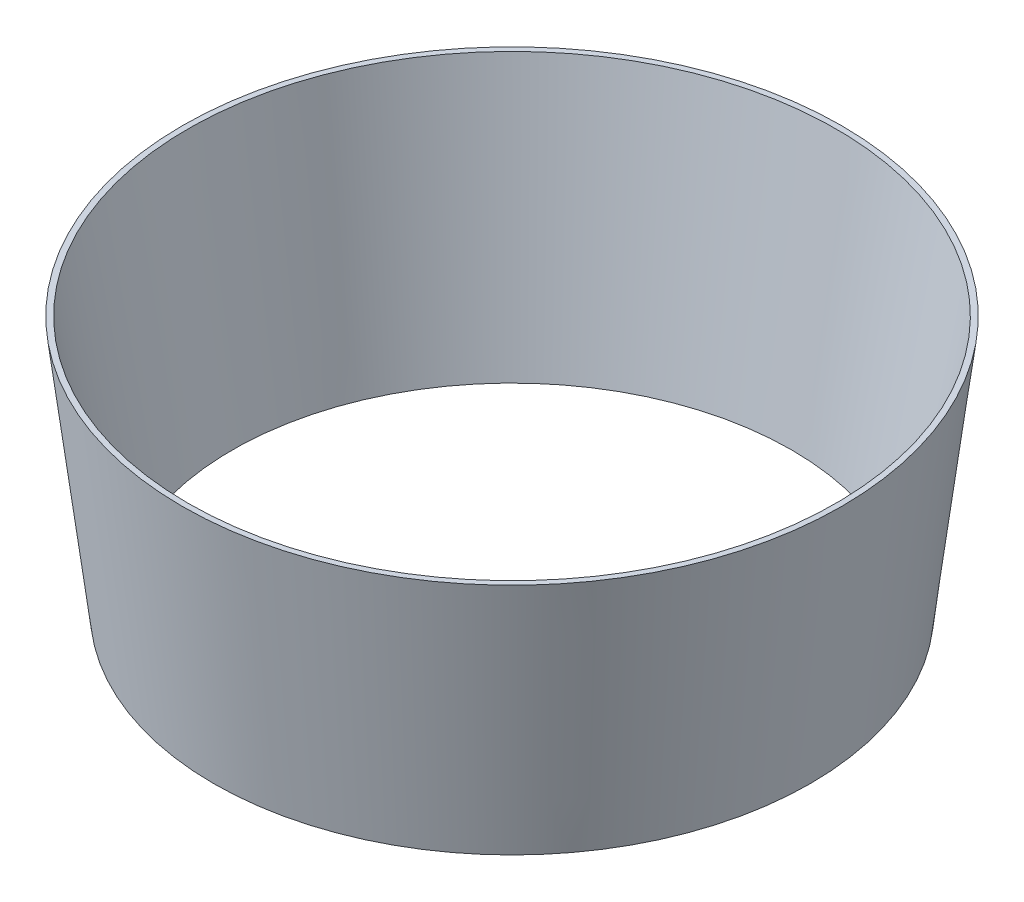
ISO-10303-21;
HEADER;
FILE_DESCRIPTION(('STEP AP214'),'2;1');
FILE_NAME('part.step','',(''),(''),'','','');
FILE_SCHEMA(('AUTOMOTIVE_DESIGN { 1 0 10303 214 1 1 1 1 }'));
ENDSEC;
DATA;
#1=APPLICATION_CONTEXT('core data for automotive mechanical design processes');
#2=APPLICATION_PROTOCOL_DEFINITION('international standard','automotive_design',2000,#1);
#3=PRODUCT_CONTEXT('',#1,'mechanical');
#4=PRODUCT('Part','Part','',(#3));
#5=PRODUCT_RELATED_PRODUCT_CATEGORY('part','',(#4));
#6=PRODUCT_DEFINITION_FORMATION('','',#4);
#7=PRODUCT_DEFINITION_CONTEXT('part definition',#1,'design');
#8=PRODUCT_DEFINITION('design','',#6,#7);
#9=PRODUCT_DEFINITION_SHAPE('','',#8);
#10=(LENGTH_UNIT() NAMED_UNIT(*) SI_UNIT(.MILLI.,.METRE.));
#11=(NAMED_UNIT(*) PLANE_ANGLE_UNIT() SI_UNIT($,.RADIAN.));
#12=(NAMED_UNIT(*) SI_UNIT($,.STERADIAN.) SOLID_ANGLE_UNIT());
#13=UNCERTAINTY_MEASURE_WITH_UNIT(LENGTH_MEASURE(1.E-05),#10,'distance_accuracy_value','');
#14=(GEOMETRIC_REPRESENTATION_CONTEXT(3) GLOBAL_UNCERTAINTY_ASSIGNED_CONTEXT((#13)) GLOBAL_UNIT_ASSIGNED_CONTEXT((#10,
#11,#12)) REPRESENTATION_CONTEXT('',''));
#15=CARTESIAN_POINT('',(0.,0.,0.));
#16=DIRECTION('',(0.,0.,1.));
#17=DIRECTION('',(1.,0.,0.));
#18=AXIS2_PLACEMENT_3D('',#15,#16,#17);
#19=CARTESIAN_POINT('',(0.,687.83,0.));
#20=DIRECTION('',(0.,1.,0.));
#21=DIRECTION('',(0.,0.,1.));
#22=AXIS2_PLACEMENT_3D('',#19,#20,#21);
#23=PLANE('',#22);
#24=CARTESIAN_POINT('',(0.,687.83,0.));
#25=DIRECTION('',(0.,1.,0.));
#26=DIRECTION('',(0.,0.,1.));
#27=AXIS2_PLACEMENT_3D('',#24,#25,#26);
#28=CIRCLE('',#27,871.455);
#29=CARTESIAN_POINT('',(0.,687.83,871.455));
#30=VERTEX_POINT('',#29);
#31=EDGE_CURVE('E106',#30,#30,#28,.T.);
#32=ORIENTED_EDGE('',*,*,#31,.F.);
#33=EDGE_LOOP('',(#32));
#34=FACE_BOUND('',#33,.T.);
#35=CARTESIAN_POINT('',(0.,687.83,0.));
#36=DIRECTION('',(0.,1.,0.));
#37=DIRECTION('',(0.,0.,1.));
#38=AXIS2_PLACEMENT_3D('',#35,#36,#37);
#39=CIRCLE('',#38,886.455);
#40=CARTESIAN_POINT('',(0.,687.83,886.455));
#41=VERTEX_POINT('',#40);
#42=EDGE_CURVE('E11',#41,#41,#39,.T.);
#43=ORIENTED_EDGE('',*,*,#42,.T.);
#44=EDGE_LOOP('',(#43));
#45=FACE_BOUND('',#44,.T.);
#46=ADVANCED_FACE('F37',(#34,#45),#23,.T.);
#47=CARTESIAN_POINT('',(0.,0.,0.));
#48=DIRECTION('',(0.,1.,0.));
#49=DIRECTION('',(0.,0.,1.));
#50=AXIS2_PLACEMENT_3D('',#47,#48,#49);
#51=PLANE('',#50);
#52=CARTESIAN_POINT('',(0.,0.,0.));
#53=DIRECTION('',(0.,-1.,0.));
#54=DIRECTION('',(0.,0.,-1.));
#55=AXIS2_PLACEMENT_3D('',#52,#53,#54);
#56=CIRCLE('',#55,752.);
#57=CARTESIAN_POINT('',(0.,0.,-752.));
#58=VERTEX_POINT('',#57);
#59=EDGE_CURVE('E50',#58,#58,#56,.T.);
#60=ORIENTED_EDGE('',*,*,#59,.F.);
#61=EDGE_LOOP('',(#60));
#62=FACE_BOUND('',#61,.T.);
#63=CARTESIAN_POINT('',(0.,0.,0.));
#64=DIRECTION('',(0.,1.,0.));
#65=DIRECTION('',(0.,0.,1.));
#66=AXIS2_PLACEMENT_3D('',#63,#64,#65);
#67=CIRCLE('',#66,802.);
#68=CARTESIAN_POINT('',(0.,0.,802.));
#69=VERTEX_POINT('',#68);
#70=EDGE_CURVE('E45',#69,#69,#67,.T.);
#71=ORIENTED_EDGE('',*,*,#70,.F.);
#72=EDGE_LOOP('',(#71));
#73=FACE_BOUND('',#72,.T.);
#74=ADVANCED_FACE('F69',(#62,#73),#51,.F.);
#75=CARTESIAN_POINT('',(0.,0.,0.));
#76=DIRECTION('',(0.,1.,0.));
#77=DIRECTION('',(0.,0.,1.));
#78=AXIS2_PLACEMENT_3D('',#75,#76,#77);
#79=CONICAL_SURFACE('',#78,802.,0.122173184382924);
#80=ORIENTED_EDGE('',*,*,#70,.T.);
#81=EDGE_LOOP('',(#80));
#82=FACE_BOUND('',#81,.T.);
#83=ORIENTED_EDGE('',*,*,#42,.F.);
#84=EDGE_LOOP('',(#83));
#85=FACE_BOUND('',#84,.T.);
#86=ADVANCED_FACE('F78',(#82,#85),#79,.T.);
#87=CARTESIAN_POINT('',(0.,0.,0.));
#88=DIRECTION('',(0.,1.,0.));
#89=DIRECTION('',(0.,0.,1.));
#90=AXIS2_PLACEMENT_3D('',#87,#88,#89);
#91=CONICAL_SURFACE('',#90,752.,0.17195428113135);
#92=ORIENTED_EDGE('',*,*,#31,.T.);
#93=EDGE_LOOP('',(#92));
#94=FACE_BOUND('',#93,.T.);
#95=ORIENTED_EDGE('',*,*,#59,.T.);
#96=EDGE_LOOP('',(#95));
#97=FACE_BOUND('',#96,.T.);
#98=ADVANCED_FACE('F80',(#94,#97),#91,.F.);
#99=CLOSED_SHELL('',(#46,#74,#86,#98));
#100=MANIFOLD_SOLID_BREP('B2',#99);
#101=ADVANCED_BREP_SHAPE_REPRESENTATION('',(#18,#100),#14);
#102=SHAPE_DEFINITION_REPRESENTATION(#9,#101);
ENDSEC;
END-ISO-10303-21;
